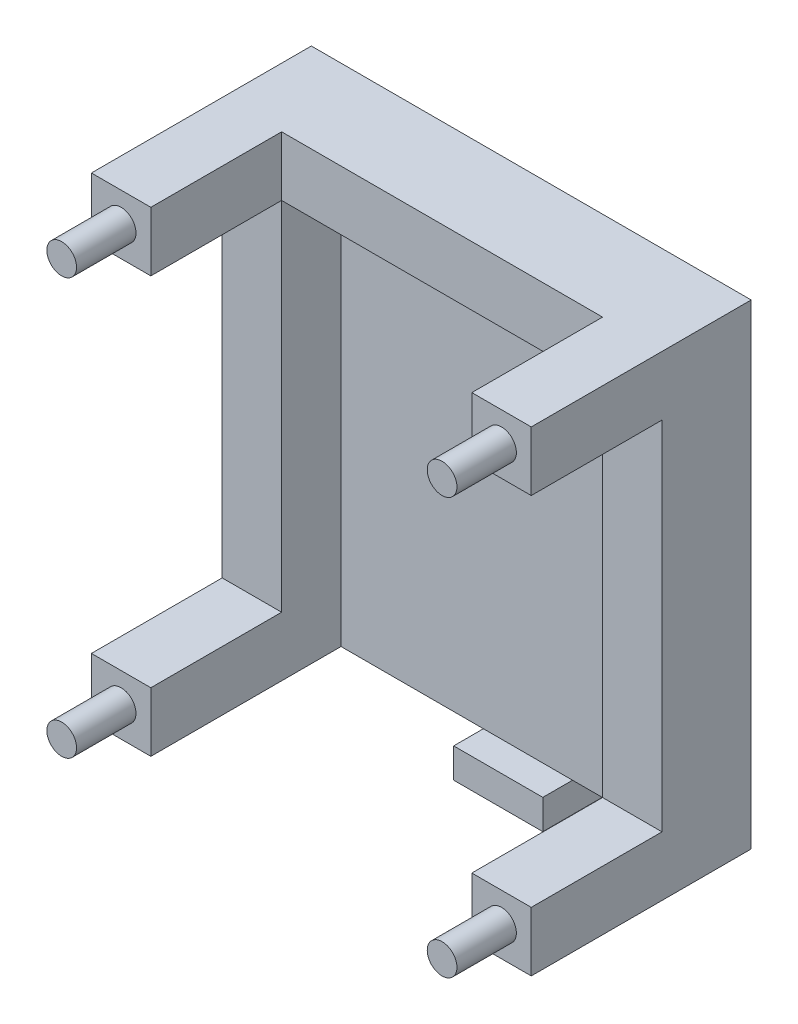
ISO-10303-21;
HEADER;
FILE_DESCRIPTION(('STEP AP214'),'2;1');
FILE_NAME('part.step','',(''),(''),'','','');
FILE_SCHEMA(('AUTOMOTIVE_DESIGN { 1 0 10303 214 1 1 1 1 }'));
ENDSEC;
DATA;
#1=APPLICATION_CONTEXT('core data for automotive mechanical design processes');
#2=APPLICATION_PROTOCOL_DEFINITION('international standard','automotive_design',2000,#1);
#3=PRODUCT_CONTEXT('',#1,'mechanical');
#4=PRODUCT('Part','Part','',(#3));
#5=PRODUCT_RELATED_PRODUCT_CATEGORY('part','',(#4));
#6=PRODUCT_DEFINITION_FORMATION('','',#4);
#7=PRODUCT_DEFINITION_CONTEXT('part definition',#1,'design');
#8=PRODUCT_DEFINITION('design','',#6,#7);
#9=PRODUCT_DEFINITION_SHAPE('','',#8);
#10=(LENGTH_UNIT() NAMED_UNIT(*) SI_UNIT(.MILLI.,.METRE.));
#11=(NAMED_UNIT(*) PLANE_ANGLE_UNIT() SI_UNIT($,.RADIAN.));
#12=(NAMED_UNIT(*) SI_UNIT($,.STERADIAN.) SOLID_ANGLE_UNIT());
#13=UNCERTAINTY_MEASURE_WITH_UNIT(LENGTH_MEASURE(1.E-05),#10,'distance_accuracy_value','');
#14=(GEOMETRIC_REPRESENTATION_CONTEXT(3) GLOBAL_UNCERTAINTY_ASSIGNED_CONTEXT((#13)) GLOBAL_UNIT_ASSIGNED_CONTEXT((#10,
#11,#12)) REPRESENTATION_CONTEXT('',''));
#15=CARTESIAN_POINT('',(0.,0.,0.));
#16=DIRECTION('',(0.,0.,1.));
#17=DIRECTION('',(1.,0.,0.));
#18=AXIS2_PLACEMENT_3D('',#15,#16,#17);
#19=CARTESIAN_POINT('',(0.,-38.4913625304137,10.));
#20=DIRECTION('',(0.,1.,0.));
#21=DIRECTION('',(-1.,0.,0.));
#22=AXIS2_PLACEMENT_3D('',#19,#20,#21);
#23=PLANE('',#22);
#24=DIRECTION('',(1.,0.,0.));
#25=VECTOR('',#24,1.);
#26=CARTESIAN_POINT('',(0.,-38.4913625304137,0.));
#27=LINE('',#26,#25);
#28=CARTESIAN_POINT('',(25.3489672837016,-38.4913625304136,0.));
#29=VERTEX_POINT('',#28);
#30=CARTESIAN_POINT('',(40.3489672837016,-38.4913625304136,0.));
#31=VERTEX_POINT('',#30);
#32=EDGE_CURVE('E112',#29,#31,#27,.T.);
#33=ORIENTED_EDGE('',*,*,#32,.T.);
#34=DIRECTION('',(0.,0.,-1.));
#35=VECTOR('',#34,1.);
#36=CARTESIAN_POINT('',(40.3489672837016,-38.4913625304136,10.));
#37=LINE('',#36,#35);
#38=CARTESIAN_POINT('',(40.3489672837016,-38.4913625304136,10.));
#39=VERTEX_POINT('',#38);
#40=EDGE_CURVE('E13',#39,#31,#37,.T.);
#41=ORIENTED_EDGE('',*,*,#40,.F.);
#42=DIRECTION('',(1.,0.,0.));
#43=VECTOR('',#42,1.);
#44=CARTESIAN_POINT('',(0.,-38.4913625304137,10.));
#45=LINE('',#44,#43);
#46=CARTESIAN_POINT('',(25.3489672837016,-38.4913625304136,10.));
#47=VERTEX_POINT('',#46);
#48=EDGE_CURVE('E107',#47,#39,#45,.T.);
#49=ORIENTED_EDGE('',*,*,#48,.F.);
#50=DIRECTION('',(0.,0.,-1.));
#51=VECTOR('',#50,1.);
#52=CARTESIAN_POINT('',(25.3489672837016,-38.4913625304136,10.));
#53=LINE('',#52,#51);
#54=EDGE_CURVE('E51',#47,#29,#53,.T.);
#55=ORIENTED_EDGE('',*,*,#54,.T.);
#56=EDGE_LOOP('',(#33,#41,#49,#55));
#57=FACE_BOUND('',#56,.T.);
#58=ADVANCED_FACE('F48',(#57),#23,.F.);
#59=CARTESIAN_POINT('',(40.3489672837016,0.,10.));
#60=DIRECTION('',(-1.,0.,0.));
#61=DIRECTION('',(0.,0.,1.));
#62=AXIS2_PLACEMENT_3D('',#59,#60,#61);
#63=PLANE('',#62);
#64=DIRECTION('',(0.,1.,0.));
#65=VECTOR('',#64,1.);
#66=CARTESIAN_POINT('',(40.3489672837016,0.,0.));
#67=LINE('',#66,#65);
#68=CARTESIAN_POINT('',(40.3489672837016,-33.4913625304136,0.));
#69=VERTEX_POINT('',#68);
#70=EDGE_CURVE('E79',#31,#69,#67,.T.);
#71=ORIENTED_EDGE('',*,*,#70,.T.);
#72=DIRECTION('',(0.,0.,-1.));
#73=VECTOR('',#72,1.);
#74=CARTESIAN_POINT('',(40.3489672837016,-33.4913625304136,10.));
#75=LINE('',#74,#73);
#76=CARTESIAN_POINT('',(40.3489672837016,-33.4913625304136,10.));
#77=VERTEX_POINT('',#76);
#78=EDGE_CURVE('E57',#77,#69,#75,.T.);
#79=ORIENTED_EDGE('',*,*,#78,.F.);
#80=DIRECTION('',(0.,1.,0.));
#81=VECTOR('',#80,1.);
#82=CARTESIAN_POINT('',(40.3489672837016,0.,10.));
#83=LINE('',#82,#81);
#84=EDGE_CURVE('E65',#39,#77,#83,.T.);
#85=ORIENTED_EDGE('',*,*,#84,.F.);
#86=ORIENTED_EDGE('',*,*,#40,.T.);
#87=EDGE_LOOP('',(#71,#79,#85,#86));
#88=FACE_BOUND('',#87,.T.);
#89=ADVANCED_FACE('F122',(#88),#63,.F.);
#90=CARTESIAN_POINT('',(0.,-33.4913625304136,10.));
#91=DIRECTION('',(0.,-1.,0.));
#92=DIRECTION('',(1.,0.,0.));
#93=AXIS2_PLACEMENT_3D('',#90,#91,#92);
#94=PLANE('',#93);
#95=DIRECTION('',(-1.,0.,0.));
#96=VECTOR('',#95,1.);
#97=CARTESIAN_POINT('',(0.,-33.4913625304136,0.));
#98=LINE('',#97,#96);
#99=CARTESIAN_POINT('',(25.3489672837016,-33.4913625304136,0.));
#100=VERTEX_POINT('',#99);
#101=EDGE_CURVE('E101',#69,#100,#98,.T.);
#102=ORIENTED_EDGE('',*,*,#101,.T.);
#103=DIRECTION('',(0.,0.,-1.));
#104=VECTOR('',#103,1.);
#105=CARTESIAN_POINT('',(25.3489672837016,-33.4913625304136,10.));
#106=LINE('',#105,#104);
#107=CARTESIAN_POINT('',(25.3489672837016,-33.4913625304136,10.));
#108=VERTEX_POINT('',#107);
#109=EDGE_CURVE('E99',#108,#100,#106,.T.);
#110=ORIENTED_EDGE('',*,*,#109,.F.);
#111=DIRECTION('',(-1.,0.,0.));
#112=VECTOR('',#111,1.);
#113=CARTESIAN_POINT('',(0.,-33.4913625304136,10.));
#114=LINE('',#113,#112);
#115=EDGE_CURVE('E93',#77,#108,#114,.T.);
#116=ORIENTED_EDGE('',*,*,#115,.F.);
#117=ORIENTED_EDGE('',*,*,#78,.T.);
#118=EDGE_LOOP('',(#102,#110,#116,#117));
#119=FACE_BOUND('',#118,.T.);
#120=ADVANCED_FACE('F100',(#119),#94,.F.);
#121=CARTESIAN_POINT('',(25.3489672837016,0.,10.));
#122=DIRECTION('',(1.,0.,0.));
#123=DIRECTION('',(0.,0.,-1.));
#124=AXIS2_PLACEMENT_3D('',#121,#122,#123);
#125=PLANE('',#124);
#126=DIRECTION('',(0.,-1.,0.));
#127=VECTOR('',#126,1.);
#128=CARTESIAN_POINT('',(25.3489672837016,0.,0.));
#129=LINE('',#128,#127);
#130=EDGE_CURVE('E115',#100,#29,#129,.T.);
#131=ORIENTED_EDGE('',*,*,#130,.T.);
#132=ORIENTED_EDGE('',*,*,#54,.F.);
#133=DIRECTION('',(0.,-1.,0.));
#134=VECTOR('',#133,1.);
#135=CARTESIAN_POINT('',(25.3489672837016,0.,10.));
#136=LINE('',#135,#134);
#137=EDGE_CURVE('E90',#108,#47,#136,.T.);
#138=ORIENTED_EDGE('',*,*,#137,.F.);
#139=ORIENTED_EDGE('',*,*,#109,.T.);
#140=EDGE_LOOP('',(#131,#132,#138,#139));
#141=FACE_BOUND('',#140,.T.);
#142=ADVANCED_FACE('F104',(#141),#125,.F.);
#143=CARTESIAN_POINT('',(0.,0.,10.));
#144=DIRECTION('',(0.,0.,-1.));
#145=DIRECTION('',(-1.,0.,0.));
#146=AXIS2_PLACEMENT_3D('',#143,#144,#145);
#147=PLANE('',#146);
#148=ORIENTED_EDGE('',*,*,#48,.T.);
#149=ORIENTED_EDGE('',*,*,#84,.T.);
#150=ORIENTED_EDGE('',*,*,#115,.T.);
#151=ORIENTED_EDGE('',*,*,#137,.T.);
#152=EDGE_LOOP('',(#148,#149,#150,#151));
#153=FACE_BOUND('',#152,.T.);
#154=ADVANCED_FACE('F95',(#153),#147,.F.);
#155=CARTESIAN_POINT('',(0.,0.,0.));
#156=DIRECTION('',(0.,0.,-1.));
#157=DIRECTION('',(-1.,0.,0.));
#158=AXIS2_PLACEMENT_3D('',#155,#156,#157);
#159=PLANE('',#158);
#160=ORIENTED_EDGE('',*,*,#32,.F.);
#161=ORIENTED_EDGE('',*,*,#130,.F.);
#162=ORIENTED_EDGE('',*,*,#101,.F.);
#163=ORIENTED_EDGE('',*,*,#70,.F.);
#164=EDGE_LOOP('',(#160,#161,#162,#163));
#165=FACE_BOUND('',#164,.T.);
#166=ADVANCED_FACE('F119',(#165),#159,.T.);
#167=CLOSED_SHELL('',(#58,#89,#120,#142,#154,#166));
#168=MANIFOLD_SOLID_BREP('B2',#167);
#169=CARTESIAN_POINT('',(0.,0.,0.));
#170=DIRECTION('',(0.,0.,-1.));
#171=DIRECTION('',(-1.,0.,0.));
#172=AXIS2_PLACEMENT_3D('',#169,#170,#171);
#173=PLANE('',#172);
#174=CARTESIAN_POINT('',(-3.59945618907709,41.5086374695864,0.));
#175=DIRECTION('',(0.,0.,-1.));
#176=DIRECTION('',(-1.,0.,0.));
#177=AXIS2_PLACEMENT_3D('',#174,#175,#176);
#178=CIRCLE('',#177,2.55);
#179=CARTESIAN_POINT('',(-6.14945618907709,41.5086374695864,0.));
#180=VERTEX_POINT('',#179);
#181=EDGE_CURVE('E564',#180,#180,#178,.F.);
#182=ORIENTED_EDGE('',*,*,#181,.T.);
#183=EDGE_LOOP('',(#182));
#184=FACE_BOUND('',#183,.T.);
#185=CARTESIAN_POINT('',(60.4005438109229,41.5086374695864,0.));
#186=DIRECTION('',(0.,0.,-1.));
#187=DIRECTION('',(-1.,0.,0.));
#188=AXIS2_PLACEMENT_3D('',#185,#186,#187);
#189=CIRCLE('',#188,2.55);
#190=CARTESIAN_POINT('',(57.8505438109229,41.5086374695864,0.));
#191=VERTEX_POINT('',#190);
#192=EDGE_CURVE('E558',#191,#191,#189,.T.);
#193=ORIENTED_EDGE('',*,*,#192,.F.);
#194=EDGE_LOOP('',(#193));
#195=FACE_BOUND('',#194,.T.);
#196=DIRECTION('',(0.,1.,0.));
#197=VECTOR('',#196,1.);
#198=CARTESIAN_POINT('',(-8.59945618907709,0.,0.));
#199=LINE('',#198,#197);
#200=CARTESIAN_POINT('',(-8.59945618907709,-33.4913625304136,0.));
#201=VERTEX_POINT('',#200);
#202=CARTESIAN_POINT('',(-8.59945618907708,46.5086374695864,0.));
#203=VERTEX_POINT('',#202);
#204=EDGE_CURVE('E336',#201,#203,#199,.T.);
#205=ORIENTED_EDGE('',*,*,#204,.T.);
#206=DIRECTION('',(1.,0.,0.));
#207=VECTOR('',#206,1.);
#208=CARTESIAN_POINT('',(55.4005438109229,46.5086374695864,0.));
#209=LINE('',#208,#207);
#210=CARTESIAN_POINT('',(65.4005438109229,46.5086374695864,0.));
#211=VERTEX_POINT('',#210);
#212=EDGE_CURVE('E399',#203,#211,#209,.T.);
#213=ORIENTED_EDGE('',*,*,#212,.T.);
#214=DIRECTION('',(0.,-1.,0.));
#215=VECTOR('',#214,1.);
#216=CARTESIAN_POINT('',(65.4005438109229,0.,0.));
#217=LINE('',#216,#215);
#218=CARTESIAN_POINT('',(65.4005438109229,-33.4913625304136,0.));
#219=VERTEX_POINT('',#218);
#220=EDGE_CURVE('E375',#211,#219,#217,.T.);
#221=ORIENTED_EDGE('',*,*,#220,.T.);
#222=DIRECTION('',(1.,0.,0.));
#223=VECTOR('',#222,1.);
#224=CARTESIAN_POINT('',(55.4005438109229,-33.4913625304136,0.));
#225=LINE('',#224,#223);
#226=EDGE_CURVE('E421',#201,#219,#225,.T.);
#227=ORIENTED_EDGE('',*,*,#226,.F.);
#228=EDGE_LOOP('',(#205,#213,#221,#227));
#229=FACE_BOUND('',#228,.T.);
#230=CARTESIAN_POINT('',(-3.59945618907709,-28.4913625304136,0.));
#231=DIRECTION('',(0.,0.,-1.));
#232=DIRECTION('',(-1.,0.,0.));
#233=AXIS2_PLACEMENT_3D('',#230,#231,#232);
#234=CIRCLE('',#233,2.55);
#235=CARTESIAN_POINT('',(-6.14945618907709,-28.4913625304136,0.));
#236=VERTEX_POINT('',#235);
#237=EDGE_CURVE('E570',#236,#236,#234,.T.);
#238=ORIENTED_EDGE('',*,*,#237,.F.);
#239=EDGE_LOOP('',(#238));
#240=FACE_BOUND('',#239,.T.);
#241=CARTESIAN_POINT('',(60.4005438109229,-28.4913625304136,0.));
#242=DIRECTION('',(0.,0.,-1.));
#243=DIRECTION('',(-1.,0.,0.));
#244=AXIS2_PLACEMENT_3D('',#241,#242,#243);
#245=CIRCLE('',#244,2.55);
#246=CARTESIAN_POINT('',(57.8505438109229,-28.4913625304136,0.));
#247=VERTEX_POINT('',#246);
#248=EDGE_CURVE('E576',#247,#247,#245,.F.);
#249=ORIENTED_EDGE('',*,*,#248,.T.);
#250=EDGE_LOOP('',(#249));
#251=FACE_BOUND('',#250,.T.);
#252=ADVANCED_FACE('F181',(#184,#195,#229,#240,#251),#173,.T.);
#253=CARTESIAN_POINT('',(0.,0.,37.));
#254=DIRECTION('',(0.,0.,-1.));
#255=DIRECTION('',(-1.,0.,0.));
#256=AXIS2_PLACEMENT_3D('',#253,#254,#255);
#257=PLANE('',#256);
#258=DIRECTION('',(-1.,0.,0.));
#259=VECTOR('',#258,1.);
#260=CARTESIAN_POINT('',(0.,-23.4913625304136,37.));
#261=LINE('',#260,#259);
#262=CARTESIAN_POINT('',(65.4005438109229,-23.4913625304136,37.));
#263=VERTEX_POINT('',#262);
#264=CARTESIAN_POINT('',(55.4005438109229,-23.4913625304136,37.));
#265=VERTEX_POINT('',#264);
#266=EDGE_CURVE('E353',#263,#265,#261,.T.);
#267=ORIENTED_EDGE('',*,*,#266,.T.);
#268=DIRECTION('',(0.,-1.,0.));
#269=VECTOR('',#268,1.);
#270=CARTESIAN_POINT('',(55.4005438109229,0.,37.));
#271=LINE('',#270,#269);
#272=CARTESIAN_POINT('',(55.4005438109229,-33.4913625304136,37.));
#273=VERTEX_POINT('',#272);
#274=EDGE_CURVE('E369',#265,#273,#271,.T.);
#275=ORIENTED_EDGE('',*,*,#274,.T.);
#276=DIRECTION('',(1.,0.,0.));
#277=VECTOR('',#276,1.);
#278=CARTESIAN_POINT('',(0.,-33.4913625304136,37.));
#279=LINE('',#278,#277);
#280=CARTESIAN_POINT('',(65.4005438109229,-33.4913625304136,37.));
#281=VERTEX_POINT('',#280);
#282=EDGE_CURVE('E367',#273,#281,#279,.T.);
#283=ORIENTED_EDGE('',*,*,#282,.T.);
#284=DIRECTION('',(0.,1.,0.));
#285=VECTOR('',#284,1.);
#286=CARTESIAN_POINT('',(65.4005438109229,0.,37.));
#287=LINE('',#286,#285);
#288=EDGE_CURVE('E365',#281,#263,#287,.T.);
#289=ORIENTED_EDGE('',*,*,#288,.T.);
#290=EDGE_LOOP('',(#267,#275,#283,#289));
#291=FACE_BOUND('',#290,.T.);
#292=CARTESIAN_POINT('',(60.4005438109229,-28.4913625304136,37.));
#293=DIRECTION('',(0.,0.,-1.));
#294=DIRECTION('',(-1.,0.,0.));
#295=AXIS2_PLACEMENT_3D('',#292,#293,#294);
#296=CIRCLE('',#295,2.5);
#297=CARTESIAN_POINT('',(57.9005438109229,-28.4913625304136,37.));
#298=VERTEX_POINT('',#297);
#299=EDGE_CURVE('E46',#298,#298,#296,.F.);
#300=ORIENTED_EDGE('',*,*,#299,.F.);
#301=EDGE_LOOP('',(#300));
#302=FACE_BOUND('',#301,.T.);
#303=ADVANCED_FACE('F529',(#291,#302),#257,.F.);
#304=CARTESIAN_POINT('',(0.,0.,37.));
#305=DIRECTION('',(0.,0.,-1.));
#306=DIRECTION('',(-1.,0.,0.));
#307=AXIS2_PLACEMENT_3D('',#304,#305,#306);
#308=PLANE('',#307);
#309=DIRECTION('',(-1.,0.,0.));
#310=VECTOR('',#309,1.);
#311=CARTESIAN_POINT('',(0.,46.5086374695864,37.));
#312=LINE('',#311,#310);
#313=CARTESIAN_POINT('',(1.40054381092291,46.5086374695864,37.));
#314=VERTEX_POINT('',#313);
#315=CARTESIAN_POINT('',(-8.59945618907708,46.5086374695864,37.));
#316=VERTEX_POINT('',#315);
#317=EDGE_CURVE('E304',#314,#316,#312,.T.);
#318=ORIENTED_EDGE('',*,*,#317,.T.);
#319=DIRECTION('',(0.,-1.,0.));
#320=VECTOR('',#319,1.);
#321=CARTESIAN_POINT('',(-8.59945618907708,0.,37.));
#322=LINE('',#321,#320);
#323=CARTESIAN_POINT('',(-8.59945618907708,36.5086374695864,37.));
#324=VERTEX_POINT('',#323);
#325=EDGE_CURVE('E320',#316,#324,#322,.T.);
#326=ORIENTED_EDGE('',*,*,#325,.T.);
#327=DIRECTION('',(1.,0.,0.));
#328=VECTOR('',#327,1.);
#329=CARTESIAN_POINT('',(0.,36.5086374695864,37.));
#330=LINE('',#329,#328);
#331=CARTESIAN_POINT('',(1.40054381092291,36.5086374695864,37.));
#332=VERTEX_POINT('',#331);
#333=EDGE_CURVE('E307',#324,#332,#330,.T.);
#334=ORIENTED_EDGE('',*,*,#333,.T.);
#335=DIRECTION('',(0.,1.,0.));
#336=VECTOR('',#335,1.);
#337=CARTESIAN_POINT('',(1.40054381092291,0.,37.));
#338=LINE('',#337,#336);
#339=EDGE_CURVE('E299',#332,#314,#338,.T.);
#340=ORIENTED_EDGE('',*,*,#339,.T.);
#341=EDGE_LOOP('',(#318,#326,#334,#340));
#342=FACE_BOUND('',#341,.T.);
#343=CARTESIAN_POINT('',(-3.59945618907709,41.5086374695864,37.));
#344=DIRECTION('',(0.,0.,-1.));
#345=DIRECTION('',(-1.,0.,0.));
#346=AXIS2_PLACEMENT_3D('',#343,#344,#345);
#347=CIRCLE('',#346,2.5);
#348=CARTESIAN_POINT('',(-6.09945618907709,41.5086374695864,37.));
#349=VERTEX_POINT('',#348);
#350=EDGE_CURVE('E189',#349,#349,#347,.F.);
#351=ORIENTED_EDGE('',*,*,#350,.F.);
#352=EDGE_LOOP('',(#351));
#353=FACE_BOUND('',#352,.T.);
#354=ADVANCED_FACE('F301',(#342,#353),#308,.F.);
#355=CARTESIAN_POINT('',(1.40054381092291,36.5086374695864,15.));
#356=DIRECTION('',(0.,-1.,0.));
#357=DIRECTION('',(0.,0.,-1.));
#358=AXIS2_PLACEMENT_3D('',#355,#356,#357);
#359=PLANE('',#358);
#360=DIRECTION('',(-1.,0.,0.));
#361=VECTOR('',#360,1.);
#362=CARTESIAN_POINT('',(1.40054381092291,36.5086374695864,15.));
#363=LINE('',#362,#361);
#364=CARTESIAN_POINT('',(55.4005438109229,36.5086374695864,15.));
#365=VERTEX_POINT('',#364);
#366=CARTESIAN_POINT('',(1.40054381092291,36.5086374695864,15.));
#367=VERTEX_POINT('',#366);
#368=EDGE_CURVE('E412',#365,#367,#363,.T.);
#369=ORIENTED_EDGE('',*,*,#368,.T.);
#370=DIRECTION('',(0.,0.,-1.));
#371=VECTOR('',#370,1.);
#372=CARTESIAN_POINT('',(1.40054381092291,36.5086374695864,15.));
#373=LINE('',#372,#371);
#374=CARTESIAN_POINT('',(1.40054381092291,36.5086374695864,5.));
#375=VERTEX_POINT('',#374);
#376=EDGE_CURVE('E442',#367,#375,#373,.T.);
#377=ORIENTED_EDGE('',*,*,#376,.T.);
#378=DIRECTION('',(-1.,0.,0.));
#379=VECTOR('',#378,1.);
#380=CARTESIAN_POINT('',(1.40054381092291,36.5086374695864,5.));
#381=LINE('',#380,#379);
#382=CARTESIAN_POINT('',(55.4005438109229,36.5086374695864,5.));
#383=VERTEX_POINT('',#382);
#384=EDGE_CURVE('E445',#383,#375,#381,.T.);
#385=ORIENTED_EDGE('',*,*,#384,.F.);
#386=DIRECTION('',(0.,0.,-1.));
#387=VECTOR('',#386,1.);
#388=CARTESIAN_POINT('',(55.4005438109229,36.5086374695864,15.));
#389=LINE('',#388,#387);
#390=EDGE_CURVE('E326',#365,#383,#389,.T.);
#391=ORIENTED_EDGE('',*,*,#390,.F.);
#392=EDGE_LOOP('',(#369,#377,#385,#391));
#393=FACE_BOUND('',#392,.T.);
#394=ADVANCED_FACE('F604',(#393),#359,.T.);
#395=DIRECTION('',(0.,0.,-1.));
#396=VECTOR('',#395,1.);
#397=CARTESIAN_POINT('',(-8.59945618907708,36.5086374695864,37.));
#398=LINE('',#397,#396);
#399=CARTESIAN_POINT('',(-8.59945618907708,36.5086374695864,15.));
#400=VERTEX_POINT('',#399);
#401=EDGE_CURVE('E337',#324,#400,#398,.T.);
#402=ORIENTED_EDGE('',*,*,#401,.T.);
#403=DIRECTION('',(-1.,0.,0.));
#404=VECTOR('',#403,1.);
#405=CARTESIAN_POINT('',(0.,36.5086374695864,15.));
#406=LINE('',#405,#404);
#407=EDGE_CURVE('E489',#367,#400,#406,.T.);
#408=ORIENTED_EDGE('',*,*,#407,.F.);
#409=DIRECTION('',(0.,0.,-1.));
#410=VECTOR('',#409,1.);
#411=CARTESIAN_POINT('',(1.40054381092291,36.5086374695864,37.));
#412=LINE('',#411,#410);
#413=EDGE_CURVE('E319',#332,#367,#412,.T.);
#414=ORIENTED_EDGE('',*,*,#413,.F.);
#415=ORIENTED_EDGE('',*,*,#333,.F.);
#416=EDGE_LOOP('',(#402,#408,#414,#415));
#417=FACE_BOUND('',#416,.T.);
#418=ADVANCED_FACE('F488',(#417),#359,.T.);
#419=CARTESIAN_POINT('',(0.,-23.4913625304136,37.));
#420=DIRECTION('',(0.,1.,0.));
#421=DIRECTION('',(-1.,0.,0.));
#422=AXIS2_PLACEMENT_3D('',#419,#420,#421);
#423=PLANE('',#422);
#424=DIRECTION('',(0.,0.,-1.));
#425=VECTOR('',#424,1.);
#426=CARTESIAN_POINT('',(1.40054381092291,-23.4913625304136,37.));
#427=LINE('',#426,#425);
#428=CARTESIAN_POINT('',(1.40054381092291,-23.4913625304136,37.));
#429=VERTEX_POINT('',#428);
#430=CARTESIAN_POINT('',(1.40054381092291,-23.4913625304136,15.));
#431=VERTEX_POINT('',#430);
#432=EDGE_CURVE('E196',#429,#431,#427,.T.);
#433=ORIENTED_EDGE('',*,*,#432,.T.);
#434=DIRECTION('',(1.,0.,0.));
#435=VECTOR('',#434,1.);
#436=CARTESIAN_POINT('',(0.,-23.4913625304136,15.));
#437=LINE('',#436,#435);
#438=CARTESIAN_POINT('',(-8.59945618907709,-23.4913625304136,15.));
#439=VERTEX_POINT('',#438);
#440=EDGE_CURVE('E200',#439,#431,#437,.T.);
#441=ORIENTED_EDGE('',*,*,#440,.F.);
#442=DIRECTION('',(0.,0.,-1.));
#443=VECTOR('',#442,1.);
#444=CARTESIAN_POINT('',(-8.59945618907709,-23.4913625304136,37.));
#445=LINE('',#444,#443);
#446=CARTESIAN_POINT('',(-8.59945618907709,-23.4913625304136,37.));
#447=VERTEX_POINT('',#446);
#448=EDGE_CURVE('E354',#447,#439,#445,.T.);
#449=ORIENTED_EDGE('',*,*,#448,.F.);
#450=DIRECTION('',(1.,0.,0.));
#451=VECTOR('',#450,1.);
#452=CARTESIAN_POINT('',(0.,-23.4913625304136,37.));
#453=LINE('',#452,#451);
#454=EDGE_CURVE('E348',#447,#429,#453,.T.);
#455=ORIENTED_EDGE('',*,*,#454,.T.);
#456=EDGE_LOOP('',(#433,#441,#449,#455));
#457=FACE_BOUND('',#456,.T.);
#458=ADVANCED_FACE('F630',(#457),#423,.T.);
#459=DIRECTION('',(0.,0.,-1.));
#460=VECTOR('',#459,1.);
#461=CARTESIAN_POINT('',(55.4005438109229,36.5086374695864,37.));
#462=LINE('',#461,#460);
#463=CARTESIAN_POINT('',(55.4005438109229,36.5086374695864,37.));
#464=VERTEX_POINT('',#463);
#465=EDGE_CURVE('E409',#464,#365,#462,.T.);
#466=ORIENTED_EDGE('',*,*,#465,.T.);
#467=DIRECTION('',(-1.,0.,0.));
#468=VECTOR('',#467,1.);
#469=CARTESIAN_POINT('',(0.,36.5086374695864,15.));
#470=LINE('',#469,#468);
#471=CARTESIAN_POINT('',(65.4005438109229,36.5086374695864,15.));
#472=VERTEX_POINT('',#471);
#473=EDGE_CURVE('E438',#472,#365,#470,.T.);
#474=ORIENTED_EDGE('',*,*,#473,.F.);
#475=DIRECTION('',(0.,0.,-1.));
#476=VECTOR('',#475,1.);
#477=CARTESIAN_POINT('',(65.4005438109229,36.5086374695864,37.));
#478=LINE('',#477,#476);
#479=CARTESIAN_POINT('',(65.4005438109229,36.5086374695864,37.));
#480=VERTEX_POINT('',#479);
#481=EDGE_CURVE('E394',#480,#472,#478,.T.);
#482=ORIENTED_EDGE('',*,*,#481,.F.);
#483=DIRECTION('',(-1.,0.,0.));
#484=VECTOR('',#483,1.);
#485=CARTESIAN_POINT('',(0.,36.5086374695864,37.));
#486=LINE('',#485,#484);
#487=EDGE_CURVE('E386',#480,#464,#486,.T.);
#488=ORIENTED_EDGE('',*,*,#487,.T.);
#489=EDGE_LOOP('',(#466,#474,#482,#488));
#490=FACE_BOUND('',#489,.T.);
#491=ADVANCED_FACE('F520',(#490),#359,.T.);
#492=CARTESIAN_POINT('',(0.,-23.4913625304136,37.));
#493=DIRECTION('',(0.,-1.,0.));
#494=DIRECTION('',(0.,0.,-1.));
#495=AXIS2_PLACEMENT_3D('',#492,#493,#494);
#496=PLANE('',#495);
#497=DIRECTION('',(1.,0.,0.));
#498=VECTOR('',#497,1.);
#499=CARTESIAN_POINT('',(0.,-23.4913625304136,15.));
#500=LINE('',#499,#498);
#501=CARTESIAN_POINT('',(55.4005438109229,-23.4913625304136,15.));
#502=VERTEX_POINT('',#501);
#503=CARTESIAN_POINT('',(65.4005438109229,-23.4913625304136,15.));
#504=VERTEX_POINT('',#503);
#505=EDGE_CURVE('E435',#502,#504,#500,.T.);
#506=ORIENTED_EDGE('',*,*,#505,.F.);
#507=DIRECTION('',(0.,0.,-1.));
#508=VECTOR('',#507,1.);
#509=CARTESIAN_POINT('',(55.4005438109229,-23.4913625304136,37.));
#510=LINE('',#509,#508);
#511=EDGE_CURVE('E372',#265,#502,#510,.T.);
#512=ORIENTED_EDGE('',*,*,#511,.F.);
#513=ORIENTED_EDGE('',*,*,#266,.F.);
#514=DIRECTION('',(0.,0.,-1.));
#515=VECTOR('',#514,1.);
#516=CARTESIAN_POINT('',(65.4005438109229,-23.4913625304136,37.));
#517=LINE('',#516,#515);
#518=EDGE_CURVE('E371',#263,#504,#517,.T.);
#519=ORIENTED_EDGE('',*,*,#518,.T.);
#520=EDGE_LOOP('',(#506,#512,#513,#519));
#521=FACE_BOUND('',#520,.T.);
#522=ADVANCED_FACE('F527',(#521),#496,.F.);
#523=CARTESIAN_POINT('',(55.4005438109229,-33.4913625304136,5.));
#524=DIRECTION('',(0.,1.,0.));
#525=DIRECTION('',(-1.,0.,0.));
#526=AXIS2_PLACEMENT_3D('',#523,#524,#525);
#527=PLANE('',#526);
#528=ORIENTED_EDGE('',*,*,#226,.T.);
#529=DIRECTION('',(0.,0.,-1.));
#530=VECTOR('',#529,1.);
#531=CARTESIAN_POINT('',(65.4005438109229,-33.4913625304136,37.));
#532=LINE('',#531,#530);
#533=EDGE_CURVE('E379',#281,#219,#532,.T.);
#534=ORIENTED_EDGE('',*,*,#533,.F.);
#535=ORIENTED_EDGE('',*,*,#282,.F.);
#536=DIRECTION('',(0.,0.,-1.));
#537=VECTOR('',#536,1.);
#538=CARTESIAN_POINT('',(55.4005438109229,-33.4913625304136,37.));
#539=LINE('',#538,#537);
#540=CARTESIAN_POINT('',(55.4005438109229,-33.4913625304136,5.));
#541=VERTEX_POINT('',#540);
#542=EDGE_CURVE('E376',#273,#541,#539,.T.);
#543=ORIENTED_EDGE('',*,*,#542,.T.);
#544=DIRECTION('',(1.,0.,0.));
#545=VECTOR('',#544,1.);
#546=CARTESIAN_POINT('',(55.4005438109229,-33.4913625304136,5.));
#547=LINE('',#546,#545);
#548=CARTESIAN_POINT('',(1.40054381092291,-33.4913625304136,5.));
#549=VERTEX_POINT('',#548);
#550=EDGE_CURVE('E427',#549,#541,#547,.T.);
#551=ORIENTED_EDGE('',*,*,#550,.F.);
#552=DIRECTION('',(0.,0.,-1.));
#553=VECTOR('',#552,1.);
#554=CARTESIAN_POINT('',(1.40054381092291,-33.4913625304136,37.));
#555=LINE('',#554,#553);
#556=CARTESIAN_POINT('',(1.40054381092291,-33.4913625304136,37.));
#557=VERTEX_POINT('',#556);
#558=EDGE_CURVE('E350',#557,#549,#555,.T.);
#559=ORIENTED_EDGE('',*,*,#558,.F.);
#560=DIRECTION('',(-1.,0.,0.));
#561=VECTOR('',#560,1.);
#562=CARTESIAN_POINT('',(0.,-33.4913625304136,37.));
#563=LINE('',#562,#561);
#564=CARTESIAN_POINT('',(-8.59945618907709,-33.4913625304136,37.));
#565=VERTEX_POINT('',#564);
#566=EDGE_CURVE('E342',#557,#565,#563,.T.);
#567=ORIENTED_EDGE('',*,*,#566,.T.);
#568=DIRECTION('',(0.,0.,-1.));
#569=VECTOR('',#568,1.);
#570=CARTESIAN_POINT('',(-8.59945618907709,-33.4913625304136,37.));
#571=LINE('',#570,#569);
#572=EDGE_CURVE('E356',#565,#201,#571,.T.);
#573=ORIENTED_EDGE('',*,*,#572,.T.);
#574=EDGE_LOOP('',(#528,#534,#535,#543,#551,#559,#567,#573));
#575=FACE_BOUND('',#574,.T.);
#576=ADVANCED_FACE('F183',(#575),#527,.F.);
#577=CARTESIAN_POINT('',(0.,0.,5.));
#578=DIRECTION('',(0.,0.,-1.));
#579=DIRECTION('',(-1.,0.,0.));
#580=AXIS2_PLACEMENT_3D('',#577,#578,#579);
#581=PLANE('',#580);
#582=DIRECTION('',(0.,-1.,0.));
#583=VECTOR('',#582,1.);
#584=CARTESIAN_POINT('',(1.40054381092291,-33.4913625304136,5.));
#585=LINE('',#584,#583);
#586=EDGE_CURVE('E430',#375,#549,#585,.T.);
#587=ORIENTED_EDGE('',*,*,#586,.T.);
#588=ORIENTED_EDGE('',*,*,#550,.T.);
#589=DIRECTION('',(0.,1.,0.));
#590=VECTOR('',#589,1.);
#591=CARTESIAN_POINT('',(55.4005438109229,36.5086374695864,5.));
#592=LINE('',#591,#590);
#593=EDGE_CURVE('E429',#541,#383,#592,.T.);
#594=ORIENTED_EDGE('',*,*,#593,.T.);
#595=ORIENTED_EDGE('',*,*,#384,.T.);
#596=EDGE_LOOP('',(#587,#588,#594,#595));
#597=FACE_BOUND('',#596,.T.);
#598=ADVANCED_FACE('F601',(#597),#581,.F.);
#599=CARTESIAN_POINT('',(55.4005438109229,46.5086374695864,15.));
#600=DIRECTION('',(0.,1.,0.));
#601=DIRECTION('',(0.,0.,1.));
#602=AXIS2_PLACEMENT_3D('',#599,#600,#601);
#603=PLANE('',#602);
#604=ORIENTED_EDGE('',*,*,#212,.F.);
#605=DIRECTION('',(0.,0.,-1.));
#606=VECTOR('',#605,1.);
#607=CARTESIAN_POINT('',(-8.59945618907708,46.5086374695864,37.));
#608=LINE('',#607,#606);
#609=EDGE_CURVE('E325',#316,#203,#608,.T.);
#610=ORIENTED_EDGE('',*,*,#609,.F.);
#611=ORIENTED_EDGE('',*,*,#317,.F.);
#612=DIRECTION('',(0.,0.,-1.));
#613=VECTOR('',#612,1.);
#614=CARTESIAN_POINT('',(1.40054381092291,46.5086374695864,37.));
#615=LINE('',#614,#613);
#616=CARTESIAN_POINT('',(1.40054381092291,46.5086374695864,15.));
#617=VERTEX_POINT('',#616);
#618=EDGE_CURVE('E314',#314,#617,#615,.T.);
#619=ORIENTED_EDGE('',*,*,#618,.T.);
#620=DIRECTION('',(1.,0.,0.));
#621=VECTOR('',#620,1.);
#622=CARTESIAN_POINT('',(55.4005438109229,46.5086374695864,15.));
#623=LINE('',#622,#621);
#624=CARTESIAN_POINT('',(55.4005438109229,46.5086374695864,15.));
#625=VERTEX_POINT('',#624);
#626=EDGE_CURVE('E411',#617,#625,#623,.T.);
#627=ORIENTED_EDGE('',*,*,#626,.T.);
#628=DIRECTION('',(0.,0.,-1.));
#629=VECTOR('',#628,1.);
#630=CARTESIAN_POINT('',(55.4005438109229,46.5086374695864,37.));
#631=LINE('',#630,#629);
#632=CARTESIAN_POINT('',(55.4005438109229,46.5086374695864,37.));
#633=VERTEX_POINT('',#632);
#634=EDGE_CURVE('E400',#633,#625,#631,.T.);
#635=ORIENTED_EDGE('',*,*,#634,.F.);
#636=DIRECTION('',(1.,0.,0.));
#637=VECTOR('',#636,1.);
#638=CARTESIAN_POINT('',(0.,46.5086374695864,37.));
#639=LINE('',#638,#637);
#640=CARTESIAN_POINT('',(65.4005438109229,46.5086374695864,37.));
#641=VERTEX_POINT('',#640);
#642=EDGE_CURVE('E391',#633,#641,#639,.T.);
#643=ORIENTED_EDGE('',*,*,#642,.T.);
#644=DIRECTION('',(0.,0.,-1.));
#645=VECTOR('',#644,1.);
#646=CARTESIAN_POINT('',(65.4005438109229,46.5086374695864,37.));
#647=LINE('',#646,#645);
#648=EDGE_CURVE('E396',#641,#211,#647,.T.);
#649=ORIENTED_EDGE('',*,*,#648,.T.);
#650=EDGE_LOOP('',(#604,#610,#611,#619,#627,#635,#643,#649));
#651=FACE_BOUND('',#650,.T.);
#652=ADVANCED_FACE('F323',(#651),#603,.T.);
#653=CARTESIAN_POINT('',(0.,0.,15.));
#654=DIRECTION('',(0.,0.,1.));
#655=DIRECTION('',(1.,0.,0.));
#656=AXIS2_PLACEMENT_3D('',#653,#654,#655);
#657=PLANE('',#656);
#658=ORIENTED_EDGE('',*,*,#368,.F.);
#659=DIRECTION('',(0.,-1.,0.));
#660=VECTOR('',#659,1.);
#661=CARTESIAN_POINT('',(55.4005438109229,36.5086374695864,15.));
#662=LINE('',#661,#660);
#663=EDGE_CURVE('E417',#625,#365,#662,.T.);
#664=ORIENTED_EDGE('',*,*,#663,.F.);
#665=ORIENTED_EDGE('',*,*,#626,.F.);
#666=DIRECTION('',(0.,1.,0.));
#667=VECTOR('',#666,1.);
#668=CARTESIAN_POINT('',(1.40054381092291,46.5086374695864,15.));
#669=LINE('',#668,#667);
#670=EDGE_CURVE('E317',#367,#617,#669,.T.);
#671=ORIENTED_EDGE('',*,*,#670,.F.);
#672=EDGE_LOOP('',(#658,#664,#665,#671));
#673=FACE_BOUND('',#672,.T.);
#674=ADVANCED_FACE('F609',(#673),#657,.T.);
#675=CARTESIAN_POINT('',(55.4005438109229,0.,37.));
#676=DIRECTION('',(1.,0.,0.));
#677=DIRECTION('',(0.,1.,0.));
#678=AXIS2_PLACEMENT_3D('',#675,#676,#677);
#679=PLANE('',#678);
#680=ORIENTED_EDGE('',*,*,#634,.T.);
#681=ORIENTED_EDGE('',*,*,#663,.T.);
#682=ORIENTED_EDGE('',*,*,#465,.F.);
#683=DIRECTION('',(0.,-1.,0.));
#684=VECTOR('',#683,1.);
#685=CARTESIAN_POINT('',(55.4005438109229,0.,37.));
#686=LINE('',#685,#684);
#687=EDGE_CURVE('E389',#633,#464,#686,.T.);
#688=ORIENTED_EDGE('',*,*,#687,.F.);
#689=EDGE_LOOP('',(#680,#681,#682,#688));
#690=FACE_BOUND('',#689,.T.);
#691=ADVANCED_FACE('F612',(#690),#679,.F.);
#692=CARTESIAN_POINT('',(65.4005438109229,0.,37.));
#693=DIRECTION('',(1.,0.,0.));
#694=DIRECTION('',(0.,0.,-1.));
#695=AXIS2_PLACEMENT_3D('',#692,#693,#694);
#696=PLANE('',#695);
#697=ORIENTED_EDGE('',*,*,#220,.F.);
#698=ORIENTED_EDGE('',*,*,#648,.F.);
#699=DIRECTION('',(0.,-1.,0.));
#700=VECTOR('',#699,1.);
#701=CARTESIAN_POINT('',(65.4005438109229,0.,37.));
#702=LINE('',#701,#700);
#703=EDGE_CURVE('E383',#641,#480,#702,.T.);
#704=ORIENTED_EDGE('',*,*,#703,.T.);
#705=ORIENTED_EDGE('',*,*,#481,.T.);
#706=DIRECTION('',(0.,-1.,0.));
#707=VECTOR('',#706,1.);
#708=CARTESIAN_POINT('',(65.4005438109229,0.,15.));
#709=LINE('',#708,#707);
#710=EDGE_CURVE('E441',#472,#504,#709,.T.);
#711=ORIENTED_EDGE('',*,*,#710,.T.);
#712=ORIENTED_EDGE('',*,*,#518,.F.);
#713=ORIENTED_EDGE('',*,*,#288,.F.);
#714=ORIENTED_EDGE('',*,*,#533,.T.);
#715=EDGE_LOOP('',(#697,#698,#704,#705,#711,#712,#713,#714));
#716=FACE_BOUND('',#715,.T.);
#717=ADVANCED_FACE('F472',(#716),#696,.T.);
#718=CARTESIAN_POINT('',(0.,0.,37.));
#719=DIRECTION('',(0.,0.,-1.));
#720=DIRECTION('',(-1.,0.,0.));
#721=AXIS2_PLACEMENT_3D('',#718,#719,#720);
#722=PLANE('',#721);
#723=CARTESIAN_POINT('',(60.4005438109229,41.5086374695864,37.));
#724=DIRECTION('',(0.,0.,1.));
#725=DIRECTION('',(1.,0.,0.));
#726=AXIS2_PLACEMENT_3D('',#723,#724,#725);
#727=CIRCLE('',#726,2.5);
#728=CARTESIAN_POINT('',(62.9005438109229,41.5086374695864,37.));
#729=VERTEX_POINT('',#728);
#730=EDGE_CURVE('E543',#729,#729,#727,.F.);
#731=ORIENTED_EDGE('',*,*,#730,.T.);
#732=EDGE_LOOP('',(#731));
#733=FACE_BOUND('',#732,.T.);
#734=ORIENTED_EDGE('',*,*,#703,.F.);
#735=ORIENTED_EDGE('',*,*,#642,.F.);
#736=ORIENTED_EDGE('',*,*,#687,.T.);
#737=ORIENTED_EDGE('',*,*,#487,.F.);
#738=EDGE_LOOP('',(#734,#735,#736,#737));
#739=FACE_BOUND('',#738,.T.);
#740=ADVANCED_FACE('F616',(#733,#739),#722,.F.);
#741=CARTESIAN_POINT('',(55.4005438109229,0.,37.));
#742=DIRECTION('',(1.,0.,0.));
#743=DIRECTION('',(0.,1.,0.));
#744=AXIS2_PLACEMENT_3D('',#741,#742,#743);
#745=PLANE('',#744);
#746=ORIENTED_EDGE('',*,*,#511,.T.);
#747=DIRECTION('',(0.,-1.,0.));
#748=VECTOR('',#747,1.);
#749=CARTESIAN_POINT('',(55.4005438109229,0.,15.));
#750=LINE('',#749,#748);
#751=EDGE_CURVE('E329',#365,#502,#750,.T.);
#752=ORIENTED_EDGE('',*,*,#751,.F.);
#753=ORIENTED_EDGE('',*,*,#390,.T.);
#754=ORIENTED_EDGE('',*,*,#593,.F.);
#755=ORIENTED_EDGE('',*,*,#542,.F.);
#756=ORIENTED_EDGE('',*,*,#274,.F.);
#757=EDGE_LOOP('',(#746,#752,#753,#754,#755,#756));
#758=FACE_BOUND('',#757,.T.);
#759=ADVANCED_FACE('F524',(#758),#745,.F.);
#760=CARTESIAN_POINT('',(1.40054381092291,0.,37.));
#761=DIRECTION('',(-1.,0.,0.));
#762=DIRECTION('',(0.,0.,1.));
#763=AXIS2_PLACEMENT_3D('',#760,#761,#762);
#764=PLANE('',#763);
#765=ORIENTED_EDGE('',*,*,#558,.T.);
#766=ORIENTED_EDGE('',*,*,#586,.F.);
#767=ORIENTED_EDGE('',*,*,#376,.F.);
#768=DIRECTION('',(0.,1.,0.));
#769=VECTOR('',#768,1.);
#770=CARTESIAN_POINT('',(1.40054381092291,0.,15.));
#771=LINE('',#770,#769);
#772=EDGE_CURVE('E493',#431,#367,#771,.T.);
#773=ORIENTED_EDGE('',*,*,#772,.F.);
#774=ORIENTED_EDGE('',*,*,#432,.F.);
#775=DIRECTION('',(0.,1.,0.));
#776=VECTOR('',#775,1.);
#777=CARTESIAN_POINT('',(1.40054381092291,0.,37.));
#778=LINE('',#777,#776);
#779=EDGE_CURVE('E340',#557,#429,#778,.T.);
#780=ORIENTED_EDGE('',*,*,#779,.F.);
#781=EDGE_LOOP('',(#765,#766,#767,#773,#774,#780));
#782=FACE_BOUND('',#781,.T.);
#783=ADVANCED_FACE('F498',(#782),#764,.F.);
#784=CARTESIAN_POINT('',(-8.59945618907709,0.,37.));
#785=DIRECTION('',(-1.,0.,0.));
#786=DIRECTION('',(0.,0.,1.));
#787=AXIS2_PLACEMENT_3D('',#784,#785,#786);
#788=PLANE('',#787);
#789=ORIENTED_EDGE('',*,*,#204,.F.);
#790=ORIENTED_EDGE('',*,*,#572,.F.);
#791=DIRECTION('',(0.,1.,0.));
#792=VECTOR('',#791,1.);
#793=CARTESIAN_POINT('',(-8.59945618907709,0.,37.));
#794=LINE('',#793,#792);
#795=EDGE_CURVE('E345',#565,#447,#794,.T.);
#796=ORIENTED_EDGE('',*,*,#795,.T.);
#797=ORIENTED_EDGE('',*,*,#448,.T.);
#798=DIRECTION('',(0.,-1.,0.));
#799=VECTOR('',#798,1.);
#800=CARTESIAN_POINT('',(-8.59945618907709,0.,15.));
#801=LINE('',#800,#799);
#802=EDGE_CURVE('E485',#400,#439,#801,.T.);
#803=ORIENTED_EDGE('',*,*,#802,.F.);
#804=ORIENTED_EDGE('',*,*,#401,.F.);
#805=ORIENTED_EDGE('',*,*,#325,.F.);
#806=ORIENTED_EDGE('',*,*,#609,.T.);
#807=EDGE_LOOP('',(#789,#790,#796,#797,#803,#804,#805,#806));
#808=FACE_BOUND('',#807,.T.);
#809=ADVANCED_FACE('F481',(#808),#788,.T.);
#810=CARTESIAN_POINT('',(0.,0.,37.));
#811=DIRECTION('',(0.,0.,-1.));
#812=DIRECTION('',(-1.,0.,0.));
#813=AXIS2_PLACEMENT_3D('',#810,#811,#812);
#814=PLANE('',#813);
#815=CARTESIAN_POINT('',(-3.59945618907709,-28.4913625304136,37.));
#816=DIRECTION('',(0.,0.,1.));
#817=DIRECTION('',(1.,0.,0.));
#818=AXIS2_PLACEMENT_3D('',#815,#816,#817);
#819=CIRCLE('',#818,2.5);
#820=CARTESIAN_POINT('',(-1.09945618907709,-28.4913625304136,37.));
#821=VERTEX_POINT('',#820);
#822=EDGE_CURVE('E552',#821,#821,#819,.F.);
#823=ORIENTED_EDGE('',*,*,#822,.T.);
#824=EDGE_LOOP('',(#823));
#825=FACE_BOUND('',#824,.T.);
#826=ORIENTED_EDGE('',*,*,#779,.T.);
#827=ORIENTED_EDGE('',*,*,#454,.F.);
#828=ORIENTED_EDGE('',*,*,#795,.F.);
#829=ORIENTED_EDGE('',*,*,#566,.F.);
#830=EDGE_LOOP('',(#826,#827,#828,#829));
#831=FACE_BOUND('',#830,.T.);
#832=ADVANCED_FACE('F535',(#825,#831),#814,.F.);
#833=CARTESIAN_POINT('',(1.40054381092291,0.,37.));
#834=DIRECTION('',(-1.,0.,0.));
#835=DIRECTION('',(0.,0.,1.));
#836=AXIS2_PLACEMENT_3D('',#833,#834,#835);
#837=PLANE('',#836);
#838=ORIENTED_EDGE('',*,*,#670,.T.);
#839=ORIENTED_EDGE('',*,*,#618,.F.);
#840=ORIENTED_EDGE('',*,*,#339,.F.);
#841=ORIENTED_EDGE('',*,*,#413,.T.);
#842=EDGE_LOOP('',(#838,#839,#840,#841));
#843=FACE_BOUND('',#842,.T.);
#844=ADVANCED_FACE('F315',(#843),#837,.F.);
#845=CARTESIAN_POINT('',(0.,0.,15.));
#846=DIRECTION('',(0.,0.,-1.));
#847=DIRECTION('',(-1.,0.,0.));
#848=AXIS2_PLACEMENT_3D('',#845,#846,#847);
#849=PLANE('',#848);
#850=ORIENTED_EDGE('',*,*,#473,.T.);
#851=ORIENTED_EDGE('',*,*,#751,.T.);
#852=ORIENTED_EDGE('',*,*,#505,.T.);
#853=ORIENTED_EDGE('',*,*,#710,.F.);
#854=EDGE_LOOP('',(#850,#851,#852,#853));
#855=FACE_BOUND('',#854,.T.);
#856=ADVANCED_FACE('F510',(#855),#849,.F.);
#857=CARTESIAN_POINT('',(0.,0.,15.));
#858=DIRECTION('',(0.,0.,-1.));
#859=DIRECTION('',(-1.,0.,0.));
#860=AXIS2_PLACEMENT_3D('',#857,#858,#859);
#861=PLANE('',#860);
#862=ORIENTED_EDGE('',*,*,#802,.T.);
#863=ORIENTED_EDGE('',*,*,#440,.T.);
#864=ORIENTED_EDGE('',*,*,#772,.T.);
#865=ORIENTED_EDGE('',*,*,#407,.T.);
#866=EDGE_LOOP('',(#862,#863,#864,#865));
#867=FACE_BOUND('',#866,.T.);
#868=ADVANCED_FACE('F495',(#867),#861,.F.);
#869=CARTESIAN_POINT('',(-3.59945618907709,41.5086374695864,47.));
#870=DIRECTION('',(0.,0.,-1.));
#871=DIRECTION('',(-1.,0.,0.));
#872=AXIS2_PLACEMENT_3D('',#869,#870,#871);
#873=CYLINDRICAL_SURFACE('',#872,2.5);
#874=CARTESIAN_POINT('',(-3.59945618907709,41.5086374695864,47.));
#875=DIRECTION('',(0.,0.,1.));
#876=DIRECTION('',(1.,0.,0.));
#877=AXIS2_PLACEMENT_3D('',#874,#875,#876);
#878=CIRCLE('',#877,2.5);
#879=CARTESIAN_POINT('',(-1.09945618907709,41.5086374695864,47.));
#880=VERTEX_POINT('',#879);
#881=EDGE_CURVE('E536',#880,#880,#878,.T.);
#882=ORIENTED_EDGE('',*,*,#881,.F.);
#883=EDGE_LOOP('',(#882));
#884=FACE_BOUND('',#883,.T.);
#885=ORIENTED_EDGE('',*,*,#350,.T.);
#886=EDGE_LOOP('',(#885));
#887=FACE_BOUND('',#886,.T.);
#888=ADVANCED_FACE('F644',(#884,#887),#873,.T.);
#889=CARTESIAN_POINT('',(0.,0.,47.));
#890=DIRECTION('',(0.,0.,1.));
#891=DIRECTION('',(1.,0.,0.));
#892=AXIS2_PLACEMENT_3D('',#889,#890,#891);
#893=PLANE('',#892);
#894=ORIENTED_EDGE('',*,*,#881,.T.);
#895=EDGE_LOOP('',(#894));
#896=FACE_BOUND('',#895,.T.);
#897=ADVANCED_FACE('F647',(#896),#893,.T.);
#898=CARTESIAN_POINT('',(60.4005438109229,41.5086374695864,47.));
#899=DIRECTION('',(0.,0.,-1.));
#900=DIRECTION('',(-1.,0.,0.));
#901=AXIS2_PLACEMENT_3D('',#898,#899,#900);
#902=CYLINDRICAL_SURFACE('',#901,2.5);
#903=CARTESIAN_POINT('',(60.4005438109229,41.5086374695864,47.));
#904=DIRECTION('',(0.,0.,1.));
#905=DIRECTION('',(1.,0.,0.));
#906=AXIS2_PLACEMENT_3D('',#903,#904,#905);
#907=CIRCLE('',#906,2.5);
#908=CARTESIAN_POINT('',(62.9005438109229,41.5086374695864,47.));
#909=VERTEX_POINT('',#908);
#910=EDGE_CURVE('E540',#909,#909,#907,.F.);
#911=ORIENTED_EDGE('',*,*,#910,.T.);
#912=EDGE_LOOP('',(#911));
#913=FACE_BOUND('',#912,.T.);
#914=ORIENTED_EDGE('',*,*,#730,.F.);
#915=EDGE_LOOP('',(#914));
#916=FACE_BOUND('',#915,.T.);
#917=ADVANCED_FACE('F651',(#913,#916),#902,.T.);
#918=CARTESIAN_POINT('',(0.,0.,47.));
#919=DIRECTION('',(0.,0.,1.));
#920=DIRECTION('',(1.,0.,0.));
#921=AXIS2_PLACEMENT_3D('',#918,#919,#920);
#922=PLANE('',#921);
#923=ORIENTED_EDGE('',*,*,#910,.F.);
#924=EDGE_LOOP('',(#923));
#925=FACE_BOUND('',#924,.T.);
#926=ADVANCED_FACE('F655',(#925),#922,.T.);
#927=CARTESIAN_POINT('',(60.4005438109229,-28.4913625304136,47.));
#928=DIRECTION('',(0.,0.,-1.));
#929=DIRECTION('',(-1.,0.,0.));
#930=AXIS2_PLACEMENT_3D('',#927,#928,#929);
#931=CYLINDRICAL_SURFACE('',#930,2.5);
#932=CARTESIAN_POINT('',(60.4005438109229,-28.4913625304136,47.));
#933=DIRECTION('',(0.,0.,1.));
#934=DIRECTION('',(1.,0.,0.));
#935=AXIS2_PLACEMENT_3D('',#932,#933,#934);
#936=CIRCLE('',#935,2.5);
#937=CARTESIAN_POINT('',(62.9005438109229,-28.4913625304136,47.));
#938=VERTEX_POINT('',#937);
#939=EDGE_CURVE('E546',#938,#938,#936,.T.);
#940=ORIENTED_EDGE('',*,*,#939,.F.);
#941=EDGE_LOOP('',(#940));
#942=FACE_BOUND('',#941,.T.);
#943=ORIENTED_EDGE('',*,*,#299,.T.);
#944=EDGE_LOOP('',(#943));
#945=FACE_BOUND('',#944,.T.);
#946=ADVANCED_FACE('F659',(#942,#945),#931,.T.);
#947=CARTESIAN_POINT('',(0.,0.,47.));
#948=DIRECTION('',(0.,0.,1.));
#949=DIRECTION('',(1.,0.,0.));
#950=AXIS2_PLACEMENT_3D('',#947,#948,#949);
#951=PLANE('',#950);
#952=ORIENTED_EDGE('',*,*,#939,.T.);
#953=EDGE_LOOP('',(#952));
#954=FACE_BOUND('',#953,.T.);
#955=ADVANCED_FACE('F663',(#954),#951,.T.);
#956=CARTESIAN_POINT('',(-3.59945618907709,-28.4913625304136,47.));
#957=DIRECTION('',(0.,0.,-1.));
#958=DIRECTION('',(-1.,0.,0.));
#959=AXIS2_PLACEMENT_3D('',#956,#957,#958);
#960=CYLINDRICAL_SURFACE('',#959,2.5);
#961=CARTESIAN_POINT('',(-3.59945618907709,-28.4913625304136,47.));
#962=DIRECTION('',(0.,0.,1.));
#963=DIRECTION('',(1.,0.,0.));
#964=AXIS2_PLACEMENT_3D('',#961,#962,#963);
#965=CIRCLE('',#964,2.5);
#966=CARTESIAN_POINT('',(-1.09945618907709,-28.4913625304136,47.));
#967=VERTEX_POINT('',#966);
#968=EDGE_CURVE('E551',#967,#967,#965,.F.);
#969=ORIENTED_EDGE('',*,*,#968,.T.);
#970=EDGE_LOOP('',(#969));
#971=FACE_BOUND('',#970,.T.);
#972=ORIENTED_EDGE('',*,*,#822,.F.);
#973=EDGE_LOOP('',(#972));
#974=FACE_BOUND('',#973,.T.);
#975=ADVANCED_FACE('F667',(#971,#974),#960,.T.);
#976=CARTESIAN_POINT('',(0.,0.,47.));
#977=DIRECTION('',(0.,0.,1.));
#978=DIRECTION('',(1.,0.,0.));
#979=AXIS2_PLACEMENT_3D('',#976,#977,#978);
#980=PLANE('',#979);
#981=ORIENTED_EDGE('',*,*,#968,.F.);
#982=EDGE_LOOP('',(#981));
#983=FACE_BOUND('',#982,.T.);
#984=ADVANCED_FACE('F671',(#983),#980,.T.);
#985=CARTESIAN_POINT('',(60.4005438109229,41.5086374695864,10.));
#986=DIRECTION('',(0.,0.,-1.));
#987=DIRECTION('',(-1.,0.,0.));
#988=AXIS2_PLACEMENT_3D('',#985,#986,#987);
#989=CYLINDRICAL_SURFACE('',#988,2.55);
#990=CARTESIAN_POINT('',(60.4005438109229,41.5086374695864,10.));
#991=DIRECTION('',(0.,0.,-1.));
#992=DIRECTION('',(-1.,0.,0.));
#993=AXIS2_PLACEMENT_3D('',#990,#991,#992);
#994=CIRCLE('',#993,2.55);
#995=CARTESIAN_POINT('',(57.8505438109229,41.5086374695864,10.));
#996=VERTEX_POINT('',#995);
#997=EDGE_CURVE('E555',#996,#996,#994,.T.);
#998=ORIENTED_EDGE('',*,*,#997,.F.);
#999=EDGE_LOOP('',(#998));
#1000=FACE_BOUND('',#999,.T.);
#1001=ORIENTED_EDGE('',*,*,#192,.T.);
#1002=EDGE_LOOP('',(#1001));
#1003=FACE_BOUND('',#1002,.T.);
#1004=ADVANCED_FACE('F675',(#1000,#1003),#989,.F.);
#1005=CARTESIAN_POINT('',(0.,0.,10.));
#1006=DIRECTION('',(0.,0.,-1.));
#1007=DIRECTION('',(-1.,0.,0.));
#1008=AXIS2_PLACEMENT_3D('',#1005,#1006,#1007);
#1009=PLANE('',#1008);
#1010=ORIENTED_EDGE('',*,*,#997,.T.);
#1011=EDGE_LOOP('',(#1010));
#1012=FACE_BOUND('',#1011,.T.);
#1013=ADVANCED_FACE('F679',(#1012),#1009,.T.);
#1014=CARTESIAN_POINT('',(-3.59945618907709,41.5086374695864,10.));
#1015=DIRECTION('',(0.,0.,-1.));
#1016=DIRECTION('',(-1.,0.,0.));
#1017=AXIS2_PLACEMENT_3D('',#1014,#1015,#1016);
#1018=CYLINDRICAL_SURFACE('',#1017,2.55);
#1019=CARTESIAN_POINT('',(-3.59945618907709,41.5086374695864,10.));
#1020=DIRECTION('',(0.,0.,-1.));
#1021=DIRECTION('',(-1.,0.,0.));
#1022=AXIS2_PLACEMENT_3D('',#1019,#1020,#1021);
#1023=CIRCLE('',#1022,2.55);
#1024=CARTESIAN_POINT('',(-6.14945618907709,41.5086374695864,10.));
#1025=VERTEX_POINT('',#1024);
#1026=EDGE_CURVE('E561',#1025,#1025,#1023,.F.);
#1027=ORIENTED_EDGE('',*,*,#1026,.T.);
#1028=EDGE_LOOP('',(#1027));
#1029=FACE_BOUND('',#1028,.T.);
#1030=ORIENTED_EDGE('',*,*,#181,.F.);
#1031=EDGE_LOOP('',(#1030));
#1032=FACE_BOUND('',#1031,.T.);
#1033=ADVANCED_FACE('F683',(#1029,#1032),#1018,.F.);
#1034=CARTESIAN_POINT('',(0.,0.,10.));
#1035=DIRECTION('',(0.,0.,-1.));
#1036=DIRECTION('',(-1.,0.,0.));
#1037=AXIS2_PLACEMENT_3D('',#1034,#1035,#1036);
#1038=PLANE('',#1037);
#1039=ORIENTED_EDGE('',*,*,#1026,.F.);
#1040=EDGE_LOOP('',(#1039));
#1041=FACE_BOUND('',#1040,.T.);
#1042=ADVANCED_FACE('F687',(#1041),#1038,.T.);
#1043=CARTESIAN_POINT('',(-3.59945618907709,-28.4913625304136,10.));
#1044=DIRECTION('',(0.,0.,-1.));
#1045=DIRECTION('',(-1.,0.,0.));
#1046=AXIS2_PLACEMENT_3D('',#1043,#1044,#1045);
#1047=CYLINDRICAL_SURFACE('',#1046,2.55);
#1048=CARTESIAN_POINT('',(-3.59945618907709,-28.4913625304136,10.));
#1049=DIRECTION('',(0.,0.,-1.));
#1050=DIRECTION('',(-1.,0.,0.));
#1051=AXIS2_PLACEMENT_3D('',#1048,#1049,#1050);
#1052=CIRCLE('',#1051,2.55);
#1053=CARTESIAN_POINT('',(-6.14945618907709,-28.4913625304136,10.));
#1054=VERTEX_POINT('',#1053);
#1055=EDGE_CURVE('E567',#1054,#1054,#1052,.T.);
#1056=ORIENTED_EDGE('',*,*,#1055,.F.);
#1057=EDGE_LOOP('',(#1056));
#1058=FACE_BOUND('',#1057,.T.);
#1059=ORIENTED_EDGE('',*,*,#237,.T.);
#1060=EDGE_LOOP('',(#1059));
#1061=FACE_BOUND('',#1060,.T.);
#1062=ADVANCED_FACE('F691',(#1058,#1061),#1047,.F.);
#1063=CARTESIAN_POINT('',(0.,0.,10.));
#1064=DIRECTION('',(0.,0.,-1.));
#1065=DIRECTION('',(-1.,0.,0.));
#1066=AXIS2_PLACEMENT_3D('',#1063,#1064,#1065);
#1067=PLANE('',#1066);
#1068=ORIENTED_EDGE('',*,*,#1055,.T.);
#1069=EDGE_LOOP('',(#1068));
#1070=FACE_BOUND('',#1069,.T.);
#1071=ADVANCED_FACE('F591',(#1070),#1067,.T.);
#1072=CARTESIAN_POINT('',(60.4005438109229,-28.4913625304136,10.));
#1073=DIRECTION('',(0.,0.,-1.));
#1074=DIRECTION('',(-1.,0.,0.));
#1075=AXIS2_PLACEMENT_3D('',#1072,#1073,#1074);
#1076=CYLINDRICAL_SURFACE('',#1075,2.55);
#1077=CARTESIAN_POINT('',(60.4005438109229,-28.4913625304136,10.));
#1078=DIRECTION('',(0.,0.,-1.));
#1079=DIRECTION('',(-1.,0.,0.));
#1080=AXIS2_PLACEMENT_3D('',#1077,#1078,#1079);
#1081=CIRCLE('',#1080,2.55);
#1082=CARTESIAN_POINT('',(57.8505438109229,-28.4913625304136,10.));
#1083=VERTEX_POINT('',#1082);
#1084=EDGE_CURVE('E573',#1083,#1083,#1081,.F.);
#1085=ORIENTED_EDGE('',*,*,#1084,.T.);
#1086=EDGE_LOOP('',(#1085));
#1087=FACE_BOUND('',#1086,.T.);
#1088=ORIENTED_EDGE('',*,*,#248,.F.);
#1089=EDGE_LOOP('',(#1088));
#1090=FACE_BOUND('',#1089,.T.);
#1091=ADVANCED_FACE('F582',(#1087,#1090),#1076,.F.);
#1092=CARTESIAN_POINT('',(0.,0.,10.));
#1093=DIRECTION('',(0.,0.,-1.));
#1094=DIRECTION('',(-1.,0.,0.));
#1095=AXIS2_PLACEMENT_3D('',#1092,#1093,#1094);
#1096=PLANE('',#1095);
#1097=ORIENTED_EDGE('',*,*,#1084,.F.);
#1098=EDGE_LOOP('',(#1097));
#1099=FACE_BOUND('',#1098,.T.);
#1100=ADVANCED_FACE('F585',(#1099),#1096,.T.);
#1101=CLOSED_SHELL('',(#252,#303,#354,#394,#418,#458,#491,#522,#576,#598,#652,#674,#691,#717,
#740,#759,#783,#809,#832,#844,#856,#868,#888,#897,#917,#926,#946,#955,#975,#984,#1004,#1013,
#1033,#1042,#1062,#1071,#1091,#1100));
#1102=MANIFOLD_SOLID_BREP('B7',#1101);
#1103=ADVANCED_BREP_SHAPE_REPRESENTATION('',(#18,#168,#1102),#14);
#1104=SHAPE_DEFINITION_REPRESENTATION(#9,#1103);
ENDSEC;
END-ISO-10303-21;
